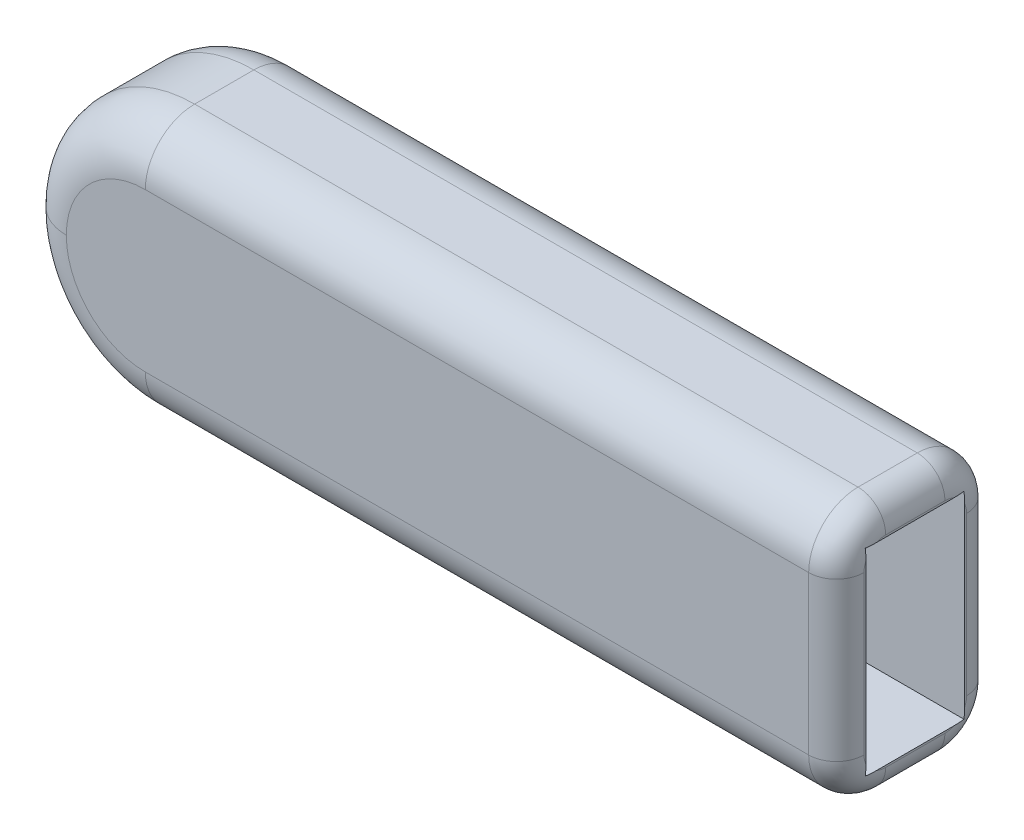
ISO-10303-21;
HEADER;
FILE_DESCRIPTION(('STEP AP214'),'2;1');
FILE_NAME('part.step','',(''),(''),'','','');
FILE_SCHEMA(('AUTOMOTIVE_DESIGN { 1 0 10303 214 1 1 1 1 }'));
ENDSEC;
DATA;
#1=APPLICATION_CONTEXT('core data for automotive mechanical design processes');
#2=APPLICATION_PROTOCOL_DEFINITION('international standard','automotive_design',2000,#1);
#3=PRODUCT_CONTEXT('',#1,'mechanical');
#4=PRODUCT('Part','Part','',(#3));
#5=PRODUCT_RELATED_PRODUCT_CATEGORY('part','',(#4));
#6=PRODUCT_DEFINITION_FORMATION('','',#4);
#7=PRODUCT_DEFINITION_CONTEXT('part definition',#1,'design');
#8=PRODUCT_DEFINITION('design','',#6,#7);
#9=PRODUCT_DEFINITION_SHAPE('','',#8);
#10=(LENGTH_UNIT() NAMED_UNIT(*) SI_UNIT(.MILLI.,.METRE.));
#11=(NAMED_UNIT(*) PLANE_ANGLE_UNIT() SI_UNIT($,.RADIAN.));
#12=(NAMED_UNIT(*) SI_UNIT($,.STERADIAN.) SOLID_ANGLE_UNIT());
#13=UNCERTAINTY_MEASURE_WITH_UNIT(LENGTH_MEASURE(1.E-05),#10,'distance_accuracy_value','');
#14=(GEOMETRIC_REPRESENTATION_CONTEXT(3) GLOBAL_UNCERTAINTY_ASSIGNED_CONTEXT((#13)) GLOBAL_UNIT_ASSIGNED_CONTEXT((#10,
#11,#12)) REPRESENTATION_CONTEXT('',''));
#15=CARTESIAN_POINT('',(0.,0.,0.));
#16=DIRECTION('',(0.,0.,1.));
#17=DIRECTION('',(1.,0.,0.));
#18=AXIS2_PLACEMENT_3D('',#15,#16,#17);
#19=CARTESIAN_POINT('',(50.8,12.7,6.35));
#20=DIRECTION('',(1.,0.,0.));
#21=DIRECTION('',(0.,0.,-1.));
#22=AXIS2_PLACEMENT_3D('',#19,#20,#21);
#23=PLANE('',#22);
#24=DIRECTION('',(0.,-1.,0.));
#25=VECTOR('',#24,1.);
#26=CARTESIAN_POINT('',(50.8,12.7,-0.127));
#27=LINE('',#26,#25);
#28=CARTESIAN_POINT('',(50.8,1.27,-0.126999999999999));
#29=VERTEX_POINT('',#28);
#30=CARTESIAN_POINT('',(50.8,11.43,-0.127));
#31=VERTEX_POINT('',#30);
#32=EDGE_CURVE('E372',#29,#31,#27,.F.);
#33=ORIENTED_EDGE('',*,*,#32,.T.);
#34=CARTESIAN_POINT('',(50.8,11.43,1.27));
#35=DIRECTION('',(1.,0.,0.));
#36=DIRECTION('',(0.,0.,-1.));
#37=AXIS2_PLACEMENT_3D('',#34,#35,#36);
#38=CIRCLE('',#37,1.397);
#39=CARTESIAN_POINT('',(50.8,12.0119871132594,0.));
#40=VERTEX_POINT('',#39);
#41=EDGE_CURVE('E376',#31,#40,#38,.T.);
#42=ORIENTED_EDGE('',*,*,#41,.T.);
#43=DIRECTION('',(0.,-1.,0.));
#44=VECTOR('',#43,1.);
#45=CARTESIAN_POINT('',(50.8,12.7,0.));
#46=LINE('',#45,#44);
#47=CARTESIAN_POINT('',(50.8,0.68801288674061,0.));
#48=VERTEX_POINT('',#47);
#49=EDGE_CURVE('E579',#40,#48,#46,.T.);
#50=ORIENTED_EDGE('',*,*,#49,.T.);
#51=CARTESIAN_POINT('',(50.8,1.27,1.27));
#52=DIRECTION('',(1.,0.,0.));
#53=DIRECTION('',(0.,0.,-1.));
#54=AXIS2_PLACEMENT_3D('',#51,#52,#53);
#55=CIRCLE('',#54,1.397);
#56=EDGE_CURVE('E369',#48,#29,#55,.T.);
#57=ORIENTED_EDGE('',*,*,#56,.T.);
#58=EDGE_LOOP('',(#33,#42,#50,#57));
#59=FACE_BOUND('',#58,.T.);
#60=ADVANCED_FACE('F51',(#59),#23,.T.);
#61=DIRECTION('',(0.,0.,-1.));
#62=VECTOR('',#61,1.);
#63=CARTESIAN_POINT('',(50.8,12.7,6.35));
#64=LINE('',#63,#62);
#65=CARTESIAN_POINT('',(50.8,12.7,5.66198711325939));
#66=VERTEX_POINT('',#65);
#67=CARTESIAN_POINT('',(50.8,12.7,0.68801288674061));
#68=VERTEX_POINT('',#67);
#69=EDGE_CURVE('E585',#66,#68,#64,.T.);
#70=ORIENTED_EDGE('',*,*,#69,.T.);
#71=CARTESIAN_POINT('',(50.8,11.43,1.27));
#72=DIRECTION('',(1.,0.,0.));
#73=DIRECTION('',(0.,0.,-1.));
#74=AXIS2_PLACEMENT_3D('',#71,#72,#73);
#75=CIRCLE('',#74,1.397);
#76=CARTESIAN_POINT('',(50.8,12.827,1.27));
#77=VERTEX_POINT('',#76);
#78=EDGE_CURVE('E366',#68,#77,#75,.T.);
#79=ORIENTED_EDGE('',*,*,#78,.T.);
#80=DIRECTION('',(0.,0.,-1.));
#81=VECTOR('',#80,1.);
#82=CARTESIAN_POINT('',(50.8,12.827,5.08));
#83=LINE('',#82,#81);
#84=CARTESIAN_POINT('',(50.8,12.827,5.08));
#85=VERTEX_POINT('',#84);
#86=EDGE_CURVE('E363',#77,#85,#83,.F.);
#87=ORIENTED_EDGE('',*,*,#86,.T.);
#88=CARTESIAN_POINT('',(50.8,11.43,5.08));
#89=DIRECTION('',(1.,0.,0.));
#90=DIRECTION('',(0.,0.,-1.));
#91=AXIS2_PLACEMENT_3D('',#88,#89,#90);
#92=CIRCLE('',#91,1.397);
#93=EDGE_CURVE('E360',#85,#66,#92,.T.);
#94=ORIENTED_EDGE('',*,*,#93,.T.);
#95=EDGE_LOOP('',(#70,#79,#87,#94));
#96=FACE_BOUND('',#95,.T.);
#97=ADVANCED_FACE('F494',(#96),#23,.T.);
#98=DIRECTION('',(0.,0.,-1.));
#99=VECTOR('',#98,1.);
#100=CARTESIAN_POINT('',(50.8,-0.127,1.27));
#101=LINE('',#100,#99);
#102=CARTESIAN_POINT('',(50.8,-0.127,5.08));
#103=VERTEX_POINT('',#102);
#104=CARTESIAN_POINT('',(50.8,-0.127,1.27));
#105=VERTEX_POINT('',#104);
#106=EDGE_CURVE('E354',#103,#105,#101,.T.);
#107=ORIENTED_EDGE('',*,*,#106,.T.);
#108=CARTESIAN_POINT('',(50.8,1.27,1.27));
#109=DIRECTION('',(1.,0.,0.));
#110=DIRECTION('',(0.,0.,-1.));
#111=AXIS2_PLACEMENT_3D('',#108,#109,#110);
#112=CIRCLE('',#111,1.397);
#113=CARTESIAN_POINT('',(50.8,0.,0.68801288674061));
#114=VERTEX_POINT('',#113);
#115=EDGE_CURVE('E357',#105,#114,#112,.T.);
#116=ORIENTED_EDGE('',*,*,#115,.T.);
#117=DIRECTION('',(0.,0.,-1.));
#118=VECTOR('',#117,1.);
#119=CARTESIAN_POINT('',(50.8,0.,6.35));
#120=LINE('',#119,#118);
#121=CARTESIAN_POINT('',(50.8,0.,5.66198711325939));
#122=VERTEX_POINT('',#121);
#123=EDGE_CURVE('E220',#122,#114,#120,.T.);
#124=ORIENTED_EDGE('',*,*,#123,.F.);
#125=CARTESIAN_POINT('',(50.8,1.27,5.08));
#126=DIRECTION('',(1.,0.,0.));
#127=DIRECTION('',(0.,0.,-1.));
#128=AXIS2_PLACEMENT_3D('',#125,#126,#127);
#129=CIRCLE('',#128,1.397);
#130=EDGE_CURVE('E351',#122,#103,#129,.T.);
#131=ORIENTED_EDGE('',*,*,#130,.T.);
#132=EDGE_LOOP('',(#107,#116,#124,#131));
#133=FACE_BOUND('',#132,.T.);
#134=ADVANCED_FACE('F501',(#133),#23,.T.);
#135=DIRECTION('',(0.,-1.,0.));
#136=VECTOR('',#135,1.);
#137=CARTESIAN_POINT('',(50.8,12.7,6.35));
#138=LINE('',#137,#136);
#139=CARTESIAN_POINT('',(50.8,12.0119871132594,6.35));
#140=VERTEX_POINT('',#139);
#141=CARTESIAN_POINT('',(50.8,0.688012886740608,6.35));
#142=VERTEX_POINT('',#141);
#143=EDGE_CURVE('E517',#140,#142,#138,.T.);
#144=ORIENTED_EDGE('',*,*,#143,.F.);
#145=CARTESIAN_POINT('',(50.8,11.43,5.08));
#146=DIRECTION('',(1.,0.,0.));
#147=DIRECTION('',(0.,0.,-1.));
#148=AXIS2_PLACEMENT_3D('',#145,#146,#147);
#149=CIRCLE('',#148,1.397);
#150=CARTESIAN_POINT('',(50.8,11.43,6.477));
#151=VERTEX_POINT('',#150);
#152=EDGE_CURVE('E348',#140,#151,#149,.T.);
#153=ORIENTED_EDGE('',*,*,#152,.T.);
#154=DIRECTION('',(0.,-1.,0.));
#155=VECTOR('',#154,1.);
#156=CARTESIAN_POINT('',(50.8,1.27,6.477));
#157=LINE('',#156,#155);
#158=CARTESIAN_POINT('',(50.8,1.27,6.477));
#159=VERTEX_POINT('',#158);
#160=EDGE_CURVE('E342',#151,#159,#157,.T.);
#161=ORIENTED_EDGE('',*,*,#160,.T.);
#162=CARTESIAN_POINT('',(50.8,1.27,5.08));
#163=DIRECTION('',(1.,0.,0.));
#164=DIRECTION('',(0.,0.,-1.));
#165=AXIS2_PLACEMENT_3D('',#162,#163,#164);
#166=CIRCLE('',#165,1.397);
#167=EDGE_CURVE('E345',#159,#142,#166,.T.);
#168=ORIENTED_EDGE('',*,*,#167,.T.);
#169=EDGE_LOOP('',(#144,#153,#161,#168));
#170=FACE_BOUND('',#169,.T.);
#171=ADVANCED_FACE('F497',(#170),#23,.T.);
#172=CARTESIAN_POINT('',(0.,-1.905,6.35));
#173=DIRECTION('',(0.,1.,0.));
#174=DIRECTION('',(0.,0.,1.));
#175=AXIS2_PLACEMENT_3D('',#172,#173,#174);
#176=PLANE('',#175);
#177=DIRECTION('',(1.,0.,0.));
#178=VECTOR('',#177,1.);
#179=CARTESIAN_POINT('',(50.8,-1.905,1.27));
#180=LINE('',#179,#178);
#181=CARTESIAN_POINT('',(6.35,-1.905,1.27));
#182=VERTEX_POINT('',#181);
#183=CARTESIAN_POINT('',(49.022,-1.905,1.27));
#184=VERTEX_POINT('',#183);
#185=EDGE_CURVE('E267',#182,#184,#180,.T.);
#186=ORIENTED_EDGE('',*,*,#185,.T.);
#187=DIRECTION('',(0.,0.,-1.));
#188=VECTOR('',#187,1.);
#189=CARTESIAN_POINT('',(49.022,-1.905,5.08));
#190=LINE('',#189,#188);
#191=CARTESIAN_POINT('',(49.022,-1.905,5.08));
#192=VERTEX_POINT('',#191);
#193=EDGE_CURVE('E437',#184,#192,#190,.F.);
#194=ORIENTED_EDGE('',*,*,#193,.T.);
#195=DIRECTION('',(1.,0.,0.));
#196=VECTOR('',#195,1.);
#197=CARTESIAN_POINT('',(0.,-1.905,5.08));
#198=LINE('',#197,#196);
#199=CARTESIAN_POINT('',(6.35,-1.905,5.08));
#200=VERTEX_POINT('',#199);
#201=EDGE_CURVE('E257',#192,#200,#198,.F.);
#202=ORIENTED_EDGE('',*,*,#201,.T.);
#203=DIRECTION('',(0.,0.,1.));
#204=VECTOR('',#203,1.);
#205=CARTESIAN_POINT('',(6.35,-1.905,6.35));
#206=LINE('',#205,#204);
#207=EDGE_CURVE('E253',#200,#182,#206,.F.);
#208=ORIENTED_EDGE('',*,*,#207,.T.);
#209=EDGE_LOOP('',(#186,#194,#202,#208));
#210=FACE_BOUND('',#209,.T.);
#211=ADVANCED_FACE('F506',(#210),#176,.F.);
#212=CARTESIAN_POINT('',(50.8,14.605,6.35));
#213=DIRECTION('',(0.,-1.,0.));
#214=DIRECTION('',(1.,0.,0.));
#215=AXIS2_PLACEMENT_3D('',#212,#213,#214);
#216=PLANE('',#215);
#217=DIRECTION('',(-1.,0.,0.));
#218=VECTOR('',#217,1.);
#219=CARTESIAN_POINT('',(50.8,14.605,5.08));
#220=LINE('',#219,#218);
#221=CARTESIAN_POINT('',(6.35,14.605,5.08));
#222=VERTEX_POINT('',#221);
#223=CARTESIAN_POINT('',(49.022,14.605,5.08));
#224=VERTEX_POINT('',#223);
#225=EDGE_CURVE('E308',#222,#224,#220,.F.);
#226=ORIENTED_EDGE('',*,*,#225,.T.);
#227=DIRECTION('',(0.,0.,-1.));
#228=VECTOR('',#227,1.);
#229=CARTESIAN_POINT('',(49.022,14.605,1.27));
#230=LINE('',#229,#228);
#231=CARTESIAN_POINT('',(49.022,14.605,1.27));
#232=VERTEX_POINT('',#231);
#233=EDGE_CURVE('E434',#224,#232,#230,.T.);
#234=ORIENTED_EDGE('',*,*,#233,.T.);
#235=DIRECTION('',(-1.,0.,0.));
#236=VECTOR('',#235,1.);
#237=CARTESIAN_POINT('',(6.35,14.605,1.27));
#238=LINE('',#237,#236);
#239=CARTESIAN_POINT('',(6.35,14.605,1.27));
#240=VERTEX_POINT('',#239);
#241=EDGE_CURVE('E312',#232,#240,#238,.T.);
#242=ORIENTED_EDGE('',*,*,#241,.T.);
#243=DIRECTION('',(0.,0.,1.));
#244=VECTOR('',#243,1.);
#245=CARTESIAN_POINT('',(6.35,14.605,6.35));
#246=LINE('',#245,#244);
#247=EDGE_CURVE('E258',#240,#222,#246,.T.);
#248=ORIENTED_EDGE('',*,*,#247,.T.);
#249=EDGE_LOOP('',(#226,#234,#242,#248));
#250=FACE_BOUND('',#249,.T.);
#251=ADVANCED_FACE('F512',(#250),#216,.F.);
#252=CARTESIAN_POINT('',(0.,0.,8.255));
#253=DIRECTION('',(0.,0.,-1.));
#254=DIRECTION('',(-1.,0.,0.));
#255=AXIS2_PLACEMENT_3D('',#252,#253,#254);
#256=PLANE('',#255);
#257=DIRECTION('',(1.,0.,0.));
#258=VECTOR('',#257,1.);
#259=CARTESIAN_POINT('',(0.,1.27,8.255));
#260=LINE('',#259,#258);
#261=CARTESIAN_POINT('',(6.35,1.27,8.255));
#262=VERTEX_POINT('',#261);
#263=CARTESIAN_POINT('',(49.022,1.27,8.255));
#264=VERTEX_POINT('',#263);
#265=EDGE_CURVE('E293',#262,#264,#260,.T.);
#266=ORIENTED_EDGE('',*,*,#265,.T.);
#267=DIRECTION('',(0.,-1.,0.));
#268=VECTOR('',#267,1.);
#269=CARTESIAN_POINT('',(49.022,11.43,8.255));
#270=LINE('',#269,#268);
#271=CARTESIAN_POINT('',(49.022,11.43,8.255));
#272=VERTEX_POINT('',#271);
#273=EDGE_CURVE('E11',#264,#272,#270,.F.);
#274=ORIENTED_EDGE('',*,*,#273,.T.);
#275=DIRECTION('',(-1.,0.,0.));
#276=VECTOR('',#275,1.);
#277=CARTESIAN_POINT('',(0.,11.43,8.255));
#278=LINE('',#277,#276);
#279=CARTESIAN_POINT('',(6.35,11.43,8.255));
#280=VERTEX_POINT('',#279);
#281=EDGE_CURVE('E284',#272,#280,#278,.T.);
#282=ORIENTED_EDGE('',*,*,#281,.T.);
#283=CARTESIAN_POINT('',(6.35,6.35000000000001,8.255));
#284=DIRECTION('',(0.,0.,-1.));
#285=DIRECTION('',(-1.,0.,0.));
#286=AXIS2_PLACEMENT_3D('',#283,#284,#285);
#287=CIRCLE('',#286,5.08);
#288=CARTESIAN_POINT('',(1.27,6.35,8.255));
#289=VERTEX_POINT('',#288);
#290=EDGE_CURVE('E287',#280,#289,#287,.F.);
#291=ORIENTED_EDGE('',*,*,#290,.T.);
#292=CARTESIAN_POINT('',(6.35,6.35,8.255));
#293=DIRECTION('',(0.,0.,-1.));
#294=DIRECTION('',(-1.,0.,0.));
#295=AXIS2_PLACEMENT_3D('',#292,#293,#294);
#296=CIRCLE('',#295,5.08);
#297=EDGE_CURVE('E290',#289,#262,#296,.F.);
#298=ORIENTED_EDGE('',*,*,#297,.T.);
#299=EDGE_LOOP('',(#266,#274,#282,#291,#298));
#300=FACE_BOUND('',#299,.T.);
#301=ADVANCED_FACE('F849',(#300),#256,.F.);
#302=CARTESIAN_POINT('',(0.,0.,-1.905));
#303=DIRECTION('',(0.,0.,-1.));
#304=DIRECTION('',(-1.,0.,0.));
#305=AXIS2_PLACEMENT_3D('',#302,#303,#304);
#306=PLANE('',#305);
#307=DIRECTION('',(-1.,0.,0.));
#308=VECTOR('',#307,1.);
#309=CARTESIAN_POINT('',(50.8,11.43,-1.905));
#310=LINE('',#309,#308);
#311=CARTESIAN_POINT('',(6.35,11.43,-1.905));
#312=VERTEX_POINT('',#311);
#313=CARTESIAN_POINT('',(49.022,11.43,-1.905));
#314=VERTEX_POINT('',#313);
#315=EDGE_CURVE('E271',#312,#314,#310,.F.);
#316=ORIENTED_EDGE('',*,*,#315,.T.);
#317=DIRECTION('',(0.,-1.,0.));
#318=VECTOR('',#317,1.);
#319=CARTESIAN_POINT('',(49.022,0.,-1.905));
#320=LINE('',#319,#318);
#321=CARTESIAN_POINT('',(49.022,1.27,-1.905));
#322=VERTEX_POINT('',#321);
#323=EDGE_CURVE('E315',#314,#322,#320,.T.);
#324=ORIENTED_EDGE('',*,*,#323,.T.);
#325=DIRECTION('',(1.,0.,0.));
#326=VECTOR('',#325,1.);
#327=CARTESIAN_POINT('',(6.35,1.27,-1.905));
#328=LINE('',#327,#326);
#329=CARTESIAN_POINT('',(6.35,1.27,-1.905));
#330=VERTEX_POINT('',#329);
#331=EDGE_CURVE('E281',#322,#330,#328,.F.);
#332=ORIENTED_EDGE('',*,*,#331,.T.);
#333=CARTESIAN_POINT('',(6.35,6.35,-1.905));
#334=DIRECTION('',(0.,0.,-1.));
#335=DIRECTION('',(-1.,0.,0.));
#336=AXIS2_PLACEMENT_3D('',#333,#334,#335);
#337=CIRCLE('',#336,5.08);
#338=CARTESIAN_POINT('',(1.27,6.35,-1.905));
#339=VERTEX_POINT('',#338);
#340=EDGE_CURVE('E278',#330,#339,#337,.T.);
#341=ORIENTED_EDGE('',*,*,#340,.T.);
#342=CARTESIAN_POINT('',(6.35,6.35000000000001,-1.905));
#343=DIRECTION('',(0.,0.,-1.));
#344=DIRECTION('',(-1.,0.,0.));
#345=AXIS2_PLACEMENT_3D('',#342,#343,#344);
#346=CIRCLE('',#345,5.08);
#347=EDGE_CURVE('E275',#339,#312,#346,.T.);
#348=ORIENTED_EDGE('',*,*,#347,.T.);
#349=EDGE_LOOP('',(#316,#324,#332,#341,#348));
#350=FACE_BOUND('',#349,.T.);
#351=ADVANCED_FACE('F842',(#350),#306,.T.);
#352=CARTESIAN_POINT('',(6.35,6.35,6.35));
#353=DIRECTION('',(0.,0.,1.));
#354=DIRECTION('',(1.,0.,0.));
#355=AXIS2_PLACEMENT_3D('',#352,#353,#354);
#356=CYLINDRICAL_SURFACE('',#355,8.255);
#357=DIRECTION('',(0.,0.,1.));
#358=VECTOR('',#357,1.);
#359=CARTESIAN_POINT('',(-1.905,6.35,6.35));
#360=LINE('',#359,#358);
#361=CARTESIAN_POINT('',(-1.905,6.35,1.27));
#362=VERTEX_POINT('',#361);
#363=CARTESIAN_POINT('',(-1.905,6.35,5.08));
#364=VERTEX_POINT('',#363);
#365=EDGE_CURVE('E251',#362,#364,#360,.T.);
#366=ORIENTED_EDGE('',*,*,#365,.F.);
#367=CARTESIAN_POINT('',(6.35,6.35,1.27));
#368=DIRECTION('',(0.,0.,-1.));
#369=DIRECTION('',(-1.,0.,0.));
#370=AXIS2_PLACEMENT_3D('',#367,#368,#369);
#371=CIRCLE('',#370,8.255);
#372=EDGE_CURVE('E299',#362,#182,#371,.F.);
#373=ORIENTED_EDGE('',*,*,#372,.T.);
#374=ORIENTED_EDGE('',*,*,#207,.F.);
#375=CARTESIAN_POINT('',(6.35,6.35,5.08));
#376=DIRECTION('',(0.,0.,-1.));
#377=DIRECTION('',(-1.,0.,0.));
#378=AXIS2_PLACEMENT_3D('',#375,#376,#377);
#379=CIRCLE('',#378,8.255);
#380=EDGE_CURVE('E296',#200,#364,#379,.T.);
#381=ORIENTED_EDGE('',*,*,#380,.T.);
#382=EDGE_LOOP('',(#366,#373,#374,#381));
#383=FACE_BOUND('',#382,.T.);
#384=ADVANCED_FACE('F848',(#383),#356,.T.);
#385=CARTESIAN_POINT('',(6.35,6.35000000000001,6.35));
#386=DIRECTION('',(0.,0.,1.));
#387=DIRECTION('',(1.,0.,0.));
#388=AXIS2_PLACEMENT_3D('',#385,#386,#387);
#389=CYLINDRICAL_SURFACE('',#388,8.255);
#390=ORIENTED_EDGE('',*,*,#247,.F.);
#391=CARTESIAN_POINT('',(6.35,6.35000000000001,1.27));
#392=DIRECTION('',(0.,0.,-1.));
#393=DIRECTION('',(-1.,0.,0.));
#394=AXIS2_PLACEMENT_3D('',#391,#392,#393);
#395=CIRCLE('',#394,8.255);
#396=EDGE_CURVE('E305',#240,#362,#395,.F.);
#397=ORIENTED_EDGE('',*,*,#396,.T.);
#398=ORIENTED_EDGE('',*,*,#365,.T.);
#399=CARTESIAN_POINT('',(6.35,6.35000000000001,5.08));
#400=DIRECTION('',(0.,0.,-1.));
#401=DIRECTION('',(-1.,0.,0.));
#402=AXIS2_PLACEMENT_3D('',#399,#400,#401);
#403=CIRCLE('',#402,8.255);
#404=EDGE_CURVE('E302',#364,#222,#403,.T.);
#405=ORIENTED_EDGE('',*,*,#404,.T.);
#406=EDGE_LOOP('',(#390,#397,#398,#405));
#407=FACE_BOUND('',#406,.T.);
#408=ADVANCED_FACE('F410',(#407),#389,.T.);
#409=CARTESIAN_POINT('',(0.,0.,6.35));
#410=DIRECTION('',(0.,1.,0.));
#411=DIRECTION('',(0.,0.,1.));
#412=AXIS2_PLACEMENT_3D('',#409,#410,#411);
#413=PLANE('',#412);
#414=ORIENTED_EDGE('',*,*,#123,.T.);
#415=CARTESIAN_POINT('',(50.8,0.,0.688012886740609));
#416=CARTESIAN_POINT('',(50.8000053117979,0.,0.630477997647595));
#417=CARTESIAN_POINT('',(50.7995166702924,0.,0.572923593735409));
#418=CARTESIAN_POINT('',(50.7968595474228,0.,0.457953639954135));
#419=CARTESIAN_POINT('',(50.7946938872655,0.,0.400538019177213));
#420=CARTESIAN_POINT('',(50.7879927165779,0.,0.285782795260271));
#421=CARTESIAN_POINT('',(50.7834552648454,0.,0.228443293016474));
#422=CARTESIAN_POINT('',(50.7714192368759,0.,0.11398388051647));
#423=CARTESIAN_POINT('',(50.7639157076623,0.,0.0568644997640226));
#424=CARTESIAN_POINT('',(50.754640216679,0.,0.));
#425=B_SPLINE_CURVE_WITH_KNOTS('',3,(#415,#416,#417,#418,#419,#420,#421,#422,#423,#424),
.UNSPECIFIED.,.F.,.F.,(4,2,2,2,4),(0.,0.172632078925998,0.34497437244895,0.517457941581219,
0.690230761660564),.UNSPECIFIED.);
#426=CARTESIAN_POINT('',(50.754640216679,0.,0.));
#427=VERTEX_POINT('',#426);
#428=EDGE_CURVE('E424',#114,#427,#425,.T.);
#429=ORIENTED_EDGE('',*,*,#428,.T.);
#430=DIRECTION('',(1.,0.,0.));
#431=VECTOR('',#430,1.);
#432=CARTESIAN_POINT('',(0.,0.,0.));
#433=LINE('',#432,#431);
#434=CARTESIAN_POINT('',(6.35,0.,0.));
#435=VERTEX_POINT('',#434);
#436=EDGE_CURVE('E574',#435,#427,#433,.T.);
#437=ORIENTED_EDGE('',*,*,#436,.F.);
#438=DIRECTION('',(0.,0.,-1.));
#439=VECTOR('',#438,1.);
#440=CARTESIAN_POINT('',(6.35,0.,0.));
#441=LINE('',#440,#439);
#442=CARTESIAN_POINT('',(6.35,0.,6.35));
#443=VERTEX_POINT('',#442);
#444=EDGE_CURVE('E213',#443,#435,#441,.T.);
#445=ORIENTED_EDGE('',*,*,#444,.F.);
#446=DIRECTION('',(1.,0.,0.));
#447=VECTOR('',#446,1.);
#448=CARTESIAN_POINT('',(0.,0.,6.35));
#449=LINE('',#448,#447);
#450=CARTESIAN_POINT('',(50.754640216679,0.,6.35));
#451=VERTEX_POINT('',#450);
#452=EDGE_CURVE('E524',#443,#451,#449,.T.);
#453=ORIENTED_EDGE('',*,*,#452,.T.);
#454=CARTESIAN_POINT('',(50.754640216679,0.,6.35));
#455=CARTESIAN_POINT('',(50.7639157076623,0.,6.29313550023598));
#456=CARTESIAN_POINT('',(50.7714192368759,0.,6.23601611948353));
#457=CARTESIAN_POINT('',(50.7834552648454,0.,6.12155670698353));
#458=CARTESIAN_POINT('',(50.7879927165779,0.,6.06421720473973));
#459=CARTESIAN_POINT('',(50.7946938872655,0.,5.94946198082279));
#460=CARTESIAN_POINT('',(50.7968595474228,0.,5.89204636004586));
#461=CARTESIAN_POINT('',(50.7995166702924,0.,5.77707640626459));
#462=CARTESIAN_POINT('',(50.8000053117979,0.,5.7195220023524));
#463=CARTESIAN_POINT('',(50.8,0.,5.66198711325939));
#464=B_SPLINE_CURVE_WITH_KNOTS('',3,(#454,#455,#456,#457,#458,#459,#460,#461,#462,#463),
.UNSPECIFIED.,.F.,.F.,(4,2,2,2,4),(0.,0.172772820079345,0.345256389211614,0.517598682734566,
0.690230761660564),.UNSPECIFIED.);
#465=EDGE_CURVE('E416',#451,#122,#464,.T.);
#466=ORIENTED_EDGE('',*,*,#465,.T.);
#467=EDGE_LOOP('',(#414,#429,#437,#445,#453,#466));
#468=FACE_BOUND('',#467,.T.);
#469=ADVANCED_FACE('F404',(#468),#413,.T.);
#470=CARTESIAN_POINT('',(50.8,12.7,6.35));
#471=DIRECTION('',(0.,-1.,0.));
#472=DIRECTION('',(1.,0.,0.));
#473=AXIS2_PLACEMENT_3D('',#470,#471,#472);
#474=PLANE('',#473);
#475=DIRECTION('',(-1.,0.,0.));
#476=VECTOR('',#475,1.);
#477=CARTESIAN_POINT('',(50.8,12.7,0.));
#478=LINE('',#477,#476);
#479=CARTESIAN_POINT('',(50.754640216679,12.7,0.));
#480=VERTEX_POINT('',#479);
#481=CARTESIAN_POINT('',(6.35,12.7,0.));
#482=VERTEX_POINT('',#481);
#483=EDGE_CURVE('E231',#480,#482,#478,.T.);
#484=ORIENTED_EDGE('',*,*,#483,.F.);
#485=CARTESIAN_POINT('',(50.754640216679,12.7,0.));
#486=CARTESIAN_POINT('',(50.7639157076623,12.7,0.0568644997640226));
#487=CARTESIAN_POINT('',(50.7714192368759,12.7,0.11398388051647));
#488=CARTESIAN_POINT('',(50.7834552648454,12.7,0.228443293016474));
#489=CARTESIAN_POINT('',(50.7879927165779,12.7,0.285782795260271));
#490=CARTESIAN_POINT('',(50.7946938872655,12.7,0.400538019177214));
#491=CARTESIAN_POINT('',(50.7968595474228,12.7,0.457953639954135));
#492=CARTESIAN_POINT('',(50.7995166702924,12.7,0.572923593735409));
#493=CARTESIAN_POINT('',(50.8000053117979,12.7,0.630477997647596));
#494=CARTESIAN_POINT('',(50.8,12.7,0.68801288674061));
#495=B_SPLINE_CURVE_WITH_KNOTS('',3,(#485,#486,#487,#488,#489,#490,#491,#492,#493,#494),
.UNSPECIFIED.,.F.,.F.,(4,2,2,2,4),(0.,0.172772820079345,0.345256389211614,0.517598682734566,
0.690230761660565),.UNSPECIFIED.);
#496=EDGE_CURVE('E473',#480,#68,#495,.T.);
#497=ORIENTED_EDGE('',*,*,#496,.T.);
#498=ORIENTED_EDGE('',*,*,#69,.F.);
#499=CARTESIAN_POINT('',(50.8,12.7,5.66198711325939));
#500=CARTESIAN_POINT('',(50.8000053117979,12.7,5.7195220023524));
#501=CARTESIAN_POINT('',(50.7995166702924,12.7,5.77707640626459));
#502=CARTESIAN_POINT('',(50.7968595474228,12.7,5.89204636004587));
#503=CARTESIAN_POINT('',(50.7946938872655,12.7,5.94946198082279));
#504=CARTESIAN_POINT('',(50.7879927165779,12.7,6.06421720473973));
#505=CARTESIAN_POINT('',(50.7834552648454,12.7,6.12155670698353));
#506=CARTESIAN_POINT('',(50.7714192368759,12.7,6.23601611948353));
#507=CARTESIAN_POINT('',(50.7639157076623,12.7,6.29313550023598));
#508=CARTESIAN_POINT('',(50.754640216679,12.7,6.35));
#509=B_SPLINE_CURVE_WITH_KNOTS('',3,(#499,#500,#501,#502,#503,#504,#505,#506,#507,#508),
.UNSPECIFIED.,.F.,.F.,(4,2,2,2,4),(0.,0.172632078925998,0.344974372448949,0.517457941581218,
0.690230761660563),.UNSPECIFIED.);
#510=CARTESIAN_POINT('',(50.754640216679,12.7,6.35));
#511=VERTEX_POINT('',#510);
#512=EDGE_CURVE('E466',#66,#511,#509,.T.);
#513=ORIENTED_EDGE('',*,*,#512,.T.);
#514=DIRECTION('',(-1.,0.,0.));
#515=VECTOR('',#514,1.);
#516=CARTESIAN_POINT('',(50.8,12.7,6.35));
#517=LINE('',#516,#515);
#518=CARTESIAN_POINT('',(6.35,12.7,6.35));
#519=VERTEX_POINT('',#518);
#520=EDGE_CURVE('E525',#511,#519,#517,.T.);
#521=ORIENTED_EDGE('',*,*,#520,.T.);
#522=DIRECTION('',(0.,0.,-1.));
#523=VECTOR('',#522,1.);
#524=CARTESIAN_POINT('',(6.35,12.7,6.35));
#525=LINE('',#524,#523);
#526=EDGE_CURVE('E238',#482,#519,#525,.F.);
#527=ORIENTED_EDGE('',*,*,#526,.F.);
#528=EDGE_LOOP('',(#484,#497,#498,#513,#521,#527));
#529=FACE_BOUND('',#528,.T.);
#530=ADVANCED_FACE('F409',(#529),#474,.T.);
#531=CARTESIAN_POINT('',(0.,0.,6.35));
#532=DIRECTION('',(0.,0.,-1.));
#533=DIRECTION('',(-1.,0.,0.));
#534=AXIS2_PLACEMENT_3D('',#531,#532,#533);
#535=PLANE('',#534);
#536=ORIENTED_EDGE('',*,*,#520,.F.);
#537=CARTESIAN_POINT('',(50.754640216679,12.7,6.35));
#538=CARTESIAN_POINT('',(50.7639157076623,12.643135500236,6.35));
#539=CARTESIAN_POINT('',(50.7714192368759,12.5860161194835,6.35));
#540=CARTESIAN_POINT('',(50.7834552648454,12.4715567069835,6.35));
#541=CARTESIAN_POINT('',(50.7879927165779,12.4142172047397,6.35));
#542=CARTESIAN_POINT('',(50.7946938872655,12.2994619808228,6.35));
#543=CARTESIAN_POINT('',(50.7968595474228,12.2420463600459,6.35));
#544=CARTESIAN_POINT('',(50.7995166702924,12.1270764062646,6.35));
#545=CARTESIAN_POINT('',(50.8000053117979,12.0695220023524,6.35));
#546=CARTESIAN_POINT('',(50.8,12.0119871132594,6.35));
#547=B_SPLINE_CURVE_WITH_KNOTS('',3,(#537,#538,#539,#540,#541,#542,#543,#544,#545,#546),
.UNSPECIFIED.,.F.,.F.,(4,2,2,2,4),(0.,0.172772820079345,0.345256389211612,0.517598682734562,
0.69023076166056),.UNSPECIFIED.);
#548=EDGE_CURVE('E447',#511,#140,#547,.T.);
#549=ORIENTED_EDGE('',*,*,#548,.T.);
#550=ORIENTED_EDGE('',*,*,#143,.T.);
#551=CARTESIAN_POINT('',(50.8,0.688012886740608,6.35));
#552=CARTESIAN_POINT('',(50.8000053117979,0.630477997647594,6.35));
#553=CARTESIAN_POINT('',(50.7995166702924,0.572923593735407,6.35));
#554=CARTESIAN_POINT('',(50.7968595474228,0.457953639954134,6.35));
#555=CARTESIAN_POINT('',(50.7946938872655,0.400538019177212,6.35));
#556=CARTESIAN_POINT('',(50.7879927165779,0.28578279526027,6.35));
#557=CARTESIAN_POINT('',(50.7834552648454,0.228443293016473,6.35));
#558=CARTESIAN_POINT('',(50.7714192368759,0.113983880516469,6.35));
#559=CARTESIAN_POINT('',(50.7639157076623,0.0568644997640221,6.35));
#560=CARTESIAN_POINT('',(50.754640216679,0.,6.35));
#561=B_SPLINE_CURVE_WITH_KNOTS('',3,(#551,#552,#553,#554,#555,#556,#557,#558,#559,#560),
.UNSPECIFIED.,.F.,.F.,(4,2,2,2,4),(0.,0.172632078925998,0.34497437244895,0.517457941581218,
0.690230761660562),.UNSPECIFIED.);
#562=EDGE_CURVE('E440',#142,#451,#561,.T.);
#563=ORIENTED_EDGE('',*,*,#562,.T.);
#564=ORIENTED_EDGE('',*,*,#452,.F.);
#565=CARTESIAN_POINT('',(6.35,6.35,6.35));
#566=DIRECTION('',(0.,0.,-1.));
#567=DIRECTION('',(-1.,0.,0.));
#568=AXIS2_PLACEMENT_3D('',#565,#566,#567);
#569=CIRCLE('',#568,6.35);
#570=CARTESIAN_POINT('',(0.,6.35,6.35));
#571=VERTEX_POINT('',#570);
#572=EDGE_CURVE('E242',#571,#443,#569,.F.);
#573=ORIENTED_EDGE('',*,*,#572,.F.);
#574=CARTESIAN_POINT('',(6.35,6.35000000000001,6.35));
#575=DIRECTION('',(0.,0.,-1.));
#576=DIRECTION('',(-1.,0.,0.));
#577=AXIS2_PLACEMENT_3D('',#574,#575,#576);
#578=CIRCLE('',#577,6.35);
#579=EDGE_CURVE('E228',#519,#571,#578,.F.);
#580=ORIENTED_EDGE('',*,*,#579,.F.);
#581=EDGE_LOOP('',(#536,#549,#550,#563,#564,#573,#580));
#582=FACE_BOUND('',#581,.T.);
#583=ADVANCED_FACE('F402',(#582),#535,.T.);
#584=CARTESIAN_POINT('',(0.,0.,0.));
#585=DIRECTION('',(0.,0.,-1.));
#586=DIRECTION('',(-1.,0.,0.));
#587=AXIS2_PLACEMENT_3D('',#584,#585,#586);
#588=PLANE('',#587);
#589=ORIENTED_EDGE('',*,*,#49,.F.);
#590=CARTESIAN_POINT('',(50.8,12.0119871132594,0.));
#591=CARTESIAN_POINT('',(50.8000053117979,12.0695220023524,0.));
#592=CARTESIAN_POINT('',(50.7995166702924,12.1270764062646,0.));
#593=CARTESIAN_POINT('',(50.7968595474228,12.2420463600459,0.));
#594=CARTESIAN_POINT('',(50.7946938872655,12.2994619808228,0.));
#595=CARTESIAN_POINT('',(50.7879927165779,12.4142172047397,0.));
#596=CARTESIAN_POINT('',(50.7834552648454,12.4715567069835,0.));
#597=CARTESIAN_POINT('',(50.7714192368759,12.5860161194835,0.));
#598=CARTESIAN_POINT('',(50.7639157076623,12.643135500236,0.));
#599=CARTESIAN_POINT('',(50.754640216679,12.7,0.));
#600=B_SPLINE_CURVE_WITH_KNOTS('',3,(#590,#591,#592,#593,#594,#595,#596,#597,#598,#599),
.UNSPECIFIED.,.F.,.F.,(4,2,2,2,4),(0.,0.172632078925998,0.34497437244895,0.517457941581217,
0.690230761660564),.UNSPECIFIED.);
#601=EDGE_CURVE('E388',#40,#480,#600,.T.);
#602=ORIENTED_EDGE('',*,*,#601,.T.);
#603=ORIENTED_EDGE('',*,*,#483,.T.);
#604=CARTESIAN_POINT('',(6.35,6.35000000000001,0.));
#605=DIRECTION('',(0.,0.,-1.));
#606=DIRECTION('',(-1.,0.,0.));
#607=AXIS2_PLACEMENT_3D('',#604,#605,#606);
#608=CIRCLE('',#607,6.35);
#609=CARTESIAN_POINT('',(0.,6.35,0.));
#610=VERTEX_POINT('',#609);
#611=EDGE_CURVE('E219',#610,#482,#608,.T.);
#612=ORIENTED_EDGE('',*,*,#611,.F.);
#613=CARTESIAN_POINT('',(6.35,6.35,0.));
#614=DIRECTION('',(0.,0.,-1.));
#615=DIRECTION('',(-1.,0.,0.));
#616=AXIS2_PLACEMENT_3D('',#613,#614,#615);
#617=CIRCLE('',#616,6.35);
#618=EDGE_CURVE('E208',#435,#610,#617,.T.);
#619=ORIENTED_EDGE('',*,*,#618,.F.);
#620=ORIENTED_EDGE('',*,*,#436,.T.);
#621=CARTESIAN_POINT('',(50.754640216679,0.,0.));
#622=CARTESIAN_POINT('',(50.7639157076623,0.0568644997640225,0.));
#623=CARTESIAN_POINT('',(50.7714192368759,0.11398388051647,0.));
#624=CARTESIAN_POINT('',(50.7834552648454,0.228443293016474,0.));
#625=CARTESIAN_POINT('',(50.7879927165779,0.285782795260271,0.));
#626=CARTESIAN_POINT('',(50.7946938872655,0.400538019177214,0.));
#627=CARTESIAN_POINT('',(50.7968595474228,0.457953639954135,0.));
#628=CARTESIAN_POINT('',(50.7995166702924,0.572923593735409,0.));
#629=CARTESIAN_POINT('',(50.8000053117979,0.630477997647596,0.));
#630=CARTESIAN_POINT('',(50.8,0.68801288674061,0.));
#631=B_SPLINE_CURVE_WITH_KNOTS('',3,(#621,#622,#623,#624,#625,#626,#627,#628,#629,#630),
.UNSPECIFIED.,.F.,.F.,(4,2,2,2,4),(0.,0.172772820079345,0.345256389211614,0.517598682734566,
0.690230761660564),.UNSPECIFIED.);
#632=EDGE_CURVE('E379',#427,#48,#631,.T.);
#633=ORIENTED_EDGE('',*,*,#632,.T.);
#634=EDGE_LOOP('',(#589,#602,#603,#612,#619,#620,#633));
#635=FACE_BOUND('',#634,.T.);
#636=ADVANCED_FACE('F235',(#635),#588,.F.);
#637=CARTESIAN_POINT('',(6.35,6.35,6.35));
#638=DIRECTION('',(0.,0.,1.));
#639=DIRECTION('',(1.,0.,0.));
#640=AXIS2_PLACEMENT_3D('',#637,#638,#639);
#641=CYLINDRICAL_SURFACE('',#640,6.35);
#642=ORIENTED_EDGE('',*,*,#444,.T.);
#643=ORIENTED_EDGE('',*,*,#618,.T.);
#644=DIRECTION('',(0.,0.,-1.));
#645=VECTOR('',#644,1.);
#646=CARTESIAN_POINT('',(0.,6.35,6.35));
#647=LINE('',#646,#645);
#648=EDGE_CURVE('E211',#610,#571,#647,.F.);
#649=ORIENTED_EDGE('',*,*,#648,.T.);
#650=ORIENTED_EDGE('',*,*,#572,.T.);
#651=EDGE_LOOP('',(#642,#643,#649,#650));
#652=FACE_BOUND('',#651,.T.);
#653=ADVANCED_FACE('F210',(#652),#641,.F.);
#654=CARTESIAN_POINT('',(6.35,6.35000000000001,6.35));
#655=DIRECTION('',(0.,0.,1.));
#656=DIRECTION('',(1.,0.,0.));
#657=AXIS2_PLACEMENT_3D('',#654,#655,#656);
#658=CYLINDRICAL_SURFACE('',#657,6.35);
#659=ORIENTED_EDGE('',*,*,#579,.T.);
#660=ORIENTED_EDGE('',*,*,#648,.F.);
#661=ORIENTED_EDGE('',*,*,#611,.T.);
#662=ORIENTED_EDGE('',*,*,#526,.T.);
#663=EDGE_LOOP('',(#659,#660,#661,#662));
#664=FACE_BOUND('',#663,.T.);
#665=ADVANCED_FACE('F224',(#664),#658,.F.);
#666=CARTESIAN_POINT('',(50.8,11.43,1.27));
#667=DIRECTION('',(1.,0.,0.));
#668=DIRECTION('',(0.,1.,0.));
#669=AXIS2_PLACEMENT_3D('',#666,#667,#668);
#670=CYLINDRICAL_SURFACE('',#669,3.175);
#671=ORIENTED_EDGE('',*,*,#241,.F.);
#672=CARTESIAN_POINT('',(49.022,11.43,1.27));
#673=DIRECTION('',(1.,0.,0.));
#674=DIRECTION('',(0.,0.,-1.));
#675=AXIS2_PLACEMENT_3D('',#672,#673,#674);
#676=CIRCLE('',#675,3.175);
#677=EDGE_CURVE('E479',#232,#314,#676,.F.);
#678=ORIENTED_EDGE('',*,*,#677,.T.);
#679=ORIENTED_EDGE('',*,*,#315,.F.);
#680=CARTESIAN_POINT('',(6.35,11.43,1.27));
#681=DIRECTION('',(-1.,0.,0.));
#682=DIRECTION('',(0.,0.,1.));
#683=AXIS2_PLACEMENT_3D('',#680,#681,#682);
#684=CIRCLE('',#683,3.175);
#685=EDGE_CURVE('E232',#240,#312,#684,.T.);
#686=ORIENTED_EDGE('',*,*,#685,.F.);
#687=EDGE_LOOP('',(#671,#678,#679,#686));
#688=FACE_BOUND('',#687,.T.);
#689=ADVANCED_FACE('F627',(#688),#670,.T.);
#690=CARTESIAN_POINT('',(6.35,6.35000000000001,1.27));
#691=DIRECTION('',(0.,0.,-1.));
#692=DIRECTION('',(-1.,0.,0.));
#693=AXIS2_PLACEMENT_3D('',#690,#691,#692);
#694=TOROIDAL_SURFACE('',#693,5.08,3.175);
#695=ORIENTED_EDGE('',*,*,#685,.T.);
#696=ORIENTED_EDGE('',*,*,#347,.F.);
#697=CARTESIAN_POINT('',(1.27,6.35,1.27));
#698=DIRECTION('',(0.,-1.,0.));
#699=DIRECTION('',(0.,0.,-1.));
#700=AXIS2_PLACEMENT_3D('',#697,#698,#699);
#701=CIRCLE('',#700,3.175);
#702=EDGE_CURVE('E320',#362,#339,#701,.T.);
#703=ORIENTED_EDGE('',*,*,#702,.F.);
#704=ORIENTED_EDGE('',*,*,#396,.F.);
#705=EDGE_LOOP('',(#695,#696,#703,#704));
#706=FACE_BOUND('',#705,.T.);
#707=ADVANCED_FACE('F633',(#706),#694,.T.);
#708=CARTESIAN_POINT('',(6.35,6.35,1.27));
#709=DIRECTION('',(0.,0.,-1.));
#710=DIRECTION('',(-1.,0.,0.));
#711=AXIS2_PLACEMENT_3D('',#708,#709,#710);
#712=TOROIDAL_SURFACE('',#711,5.08,3.175);
#713=ORIENTED_EDGE('',*,*,#702,.T.);
#714=ORIENTED_EDGE('',*,*,#340,.F.);
#715=CARTESIAN_POINT('',(6.35,1.27,1.27));
#716=DIRECTION('',(1.,0.,0.));
#717=DIRECTION('',(0.,0.,-1.));
#718=AXIS2_PLACEMENT_3D('',#715,#716,#717);
#719=CIRCLE('',#718,3.175);
#720=EDGE_CURVE('E316',#182,#330,#719,.T.);
#721=ORIENTED_EDGE('',*,*,#720,.F.);
#722=ORIENTED_EDGE('',*,*,#372,.F.);
#723=EDGE_LOOP('',(#713,#714,#721,#722));
#724=FACE_BOUND('',#723,.T.);
#725=ADVANCED_FACE('F641',(#724),#712,.T.);
#726=CARTESIAN_POINT('',(0.,1.27,1.27));
#727=DIRECTION('',(-1.,0.,0.));
#728=DIRECTION('',(0.,0.,1.));
#729=AXIS2_PLACEMENT_3D('',#726,#727,#728);
#730=CYLINDRICAL_SURFACE('',#729,3.175);
#731=ORIENTED_EDGE('',*,*,#331,.F.);
#732=CARTESIAN_POINT('',(49.022,1.27,1.27));
#733=DIRECTION('',(1.,0.,0.));
#734=DIRECTION('',(0.,0.,-1.));
#735=AXIS2_PLACEMENT_3D('',#732,#733,#734);
#736=CIRCLE('',#735,3.175);
#737=EDGE_CURVE('E431',#322,#184,#736,.F.);
#738=ORIENTED_EDGE('',*,*,#737,.T.);
#739=ORIENTED_EDGE('',*,*,#185,.F.);
#740=ORIENTED_EDGE('',*,*,#720,.T.);
#741=EDGE_LOOP('',(#731,#738,#739,#740));
#742=FACE_BOUND('',#741,.T.);
#743=ADVANCED_FACE('F649',(#742),#730,.T.);
#744=CARTESIAN_POINT('',(0.,11.43,5.08));
#745=DIRECTION('',(-1.,0.,0.));
#746=DIRECTION('',(0.,-1.,0.));
#747=AXIS2_PLACEMENT_3D('',#744,#745,#746);
#748=CYLINDRICAL_SURFACE('',#747,3.175);
#749=ORIENTED_EDGE('',*,*,#281,.F.);
#750=CARTESIAN_POINT('',(49.022,11.43,5.08));
#751=DIRECTION('',(1.,0.,0.));
#752=DIRECTION('',(0.,0.,-1.));
#753=AXIS2_PLACEMENT_3D('',#750,#751,#752);
#754=CIRCLE('',#753,3.175);
#755=EDGE_CURVE('E533',#272,#224,#754,.F.);
#756=ORIENTED_EDGE('',*,*,#755,.T.);
#757=ORIENTED_EDGE('',*,*,#225,.F.);
#758=CARTESIAN_POINT('',(6.35,11.43,5.08));
#759=DIRECTION('',(-1.,0.,0.));
#760=DIRECTION('',(0.,-1.,0.));
#761=AXIS2_PLACEMENT_3D('',#758,#759,#760);
#762=CIRCLE('',#761,3.175);
#763=EDGE_CURVE('E321',#280,#222,#762,.T.);
#764=ORIENTED_EDGE('',*,*,#763,.F.);
#765=EDGE_LOOP('',(#749,#756,#757,#764));
#766=FACE_BOUND('',#765,.T.);
#767=ADVANCED_FACE('F657',(#766),#748,.T.);
#768=CARTESIAN_POINT('',(6.35,6.35000000000001,5.08));
#769=DIRECTION('',(0.,0.,-1.));
#770=DIRECTION('',(-1.,0.,0.));
#771=AXIS2_PLACEMENT_3D('',#768,#769,#770);
#772=TOROIDAL_SURFACE('',#771,5.08,3.175);
#773=ORIENTED_EDGE('',*,*,#763,.T.);
#774=ORIENTED_EDGE('',*,*,#404,.F.);
#775=CARTESIAN_POINT('',(1.27,6.35,5.08));
#776=DIRECTION('',(0.,-1.,0.));
#777=DIRECTION('',(0.,0.,-1.));
#778=AXIS2_PLACEMENT_3D('',#775,#776,#777);
#779=CIRCLE('',#778,3.175);
#780=EDGE_CURVE('E332',#289,#364,#779,.T.);
#781=ORIENTED_EDGE('',*,*,#780,.F.);
#782=ORIENTED_EDGE('',*,*,#290,.F.);
#783=EDGE_LOOP('',(#773,#774,#781,#782));
#784=FACE_BOUND('',#783,.T.);
#785=ADVANCED_FACE('F665',(#784),#772,.T.);
#786=CARTESIAN_POINT('',(6.35,6.35,5.08));
#787=DIRECTION('',(0.,0.,-1.));
#788=DIRECTION('',(-1.,0.,0.));
#789=AXIS2_PLACEMENT_3D('',#786,#787,#788);
#790=TOROIDAL_SURFACE('',#789,5.08,3.175);
#791=ORIENTED_EDGE('',*,*,#780,.T.);
#792=ORIENTED_EDGE('',*,*,#380,.F.);
#793=CARTESIAN_POINT('',(6.35,1.27,5.08));
#794=DIRECTION('',(1.,0.,0.));
#795=DIRECTION('',(0.,0.,-1.));
#796=AXIS2_PLACEMENT_3D('',#793,#794,#795);
#797=CIRCLE('',#796,3.175);
#798=EDGE_CURVE('E328',#262,#200,#797,.T.);
#799=ORIENTED_EDGE('',*,*,#798,.F.);
#800=ORIENTED_EDGE('',*,*,#297,.F.);
#801=EDGE_LOOP('',(#791,#792,#799,#800));
#802=FACE_BOUND('',#801,.T.);
#803=ADVANCED_FACE('F672',(#802),#790,.T.);
#804=CARTESIAN_POINT('',(0.,1.27,5.08));
#805=DIRECTION('',(1.,0.,0.));
#806=DIRECTION('',(0.,0.,-1.));
#807=AXIS2_PLACEMENT_3D('',#804,#805,#806);
#808=CYLINDRICAL_SURFACE('',#807,3.175);
#809=ORIENTED_EDGE('',*,*,#201,.F.);
#810=CARTESIAN_POINT('',(49.022,1.27,5.08));
#811=DIRECTION('',(1.,0.,0.));
#812=DIRECTION('',(0.,0.,-1.));
#813=AXIS2_PLACEMENT_3D('',#810,#811,#812);
#814=CIRCLE('',#813,3.175);
#815=EDGE_CURVE('E61',#192,#264,#814,.F.);
#816=ORIENTED_EDGE('',*,*,#815,.T.);
#817=ORIENTED_EDGE('',*,*,#265,.F.);
#818=ORIENTED_EDGE('',*,*,#798,.T.);
#819=EDGE_LOOP('',(#809,#816,#817,#818));
#820=FACE_BOUND('',#819,.T.);
#821=ADVANCED_FACE('F680',(#820),#808,.T.);
#822=CARTESIAN_POINT('',(49.022,12.7,6.477));
#823=DIRECTION('',(0.,1.,0.));
#824=DIRECTION('',(0.,0.,1.));
#825=AXIS2_PLACEMENT_3D('',#822,#823,#824);
#826=CYLINDRICAL_SURFACE('',#825,1.778);
#827=CARTESIAN_POINT('',(49.022,1.27,6.477));
#828=DIRECTION('',(0.,-1.,0.));
#829=DIRECTION('',(0.,0.,-1.));
#830=AXIS2_PLACEMENT_3D('',#827,#828,#829);
#831=CIRCLE('',#830,1.778);
#832=EDGE_CURVE('E536',#159,#264,#831,.T.);
#833=ORIENTED_EDGE('',*,*,#832,.F.);
#834=ORIENTED_EDGE('',*,*,#160,.F.);
#835=CARTESIAN_POINT('',(49.022,11.43,6.477));
#836=DIRECTION('',(0.,1.,0.));
#837=DIRECTION('',(0.,0.,1.));
#838=AXIS2_PLACEMENT_3D('',#835,#836,#837);
#839=CIRCLE('',#838,1.778);
#840=EDGE_CURVE('E55',#272,#151,#839,.T.);
#841=ORIENTED_EDGE('',*,*,#840,.F.);
#842=ORIENTED_EDGE('',*,*,#273,.F.);
#843=EDGE_LOOP('',(#833,#834,#841,#842));
#844=FACE_BOUND('',#843,.T.);
#845=ADVANCED_FACE('F53',(#844),#826,.T.);
#846=CARTESIAN_POINT('',(49.022,11.43,5.08));
#847=DIRECTION('',(1.,0.,0.));
#848=DIRECTION('',(0.,0.,-1.));
#849=AXIS2_PLACEMENT_3D('',#846,#847,#848);
#850=DEGENERATE_TOROIDAL_SURFACE('',#849,1.397,1.778,.T.);
#851=ORIENTED_EDGE('',*,*,#512,.F.);
#852=ORIENTED_EDGE('',*,*,#93,.F.);
#853=CARTESIAN_POINT('',(49.022,12.827,5.08));
#854=DIRECTION('',(0.,0.,-1.));
#855=DIRECTION('',(-1.,0.,0.));
#856=AXIS2_PLACEMENT_3D('',#853,#854,#855);
#857=CIRCLE('',#856,1.778);
#858=EDGE_CURVE('E540',#224,#85,#857,.T.);
#859=ORIENTED_EDGE('',*,*,#858,.F.);
#860=ORIENTED_EDGE('',*,*,#755,.F.);
#861=ORIENTED_EDGE('',*,*,#840,.T.);
#862=ORIENTED_EDGE('',*,*,#152,.F.);
#863=ORIENTED_EDGE('',*,*,#548,.F.);
#864=EDGE_LOOP('',(#851,#852,#859,#860,#861,#862,#863));
#865=FACE_BOUND('',#864,.T.);
#866=ADVANCED_FACE('F458',(#865),#850,.T.);
#867=CARTESIAN_POINT('',(49.022,1.27,5.08));
#868=DIRECTION('',(1.,0.,0.));
#869=DIRECTION('',(0.,0.,-1.));
#870=AXIS2_PLACEMENT_3D('',#867,#868,#869);
#871=DEGENERATE_TOROIDAL_SURFACE('',#870,1.397,1.778,.T.);
#872=ORIENTED_EDGE('',*,*,#832,.T.);
#873=ORIENTED_EDGE('',*,*,#815,.F.);
#874=CARTESIAN_POINT('',(49.022,-0.127,5.08));
#875=DIRECTION('',(0.,0.,-1.));
#876=DIRECTION('',(-1.,0.,0.));
#877=AXIS2_PLACEMENT_3D('',#874,#875,#876);
#878=CIRCLE('',#877,1.778);
#879=EDGE_CURVE('E545',#103,#192,#878,.T.);
#880=ORIENTED_EDGE('',*,*,#879,.F.);
#881=ORIENTED_EDGE('',*,*,#130,.F.);
#882=ORIENTED_EDGE('',*,*,#465,.F.);
#883=ORIENTED_EDGE('',*,*,#562,.F.);
#884=ORIENTED_EDGE('',*,*,#167,.F.);
#885=EDGE_LOOP('',(#872,#873,#880,#881,#882,#883,#884));
#886=FACE_BOUND('',#885,.T.);
#887=ADVANCED_FACE('F453',(#886),#871,.T.);
#888=CARTESIAN_POINT('',(49.022,12.827,6.35));
#889=DIRECTION('',(0.,0.,1.));
#890=DIRECTION('',(1.,0.,0.));
#891=AXIS2_PLACEMENT_3D('',#888,#889,#890);
#892=CYLINDRICAL_SURFACE('',#891,1.778);
#893=ORIENTED_EDGE('',*,*,#858,.T.);
#894=ORIENTED_EDGE('',*,*,#86,.F.);
#895=CARTESIAN_POINT('',(49.022,12.827,1.27));
#896=DIRECTION('',(0.,0.,-1.));
#897=DIRECTION('',(-1.,0.,0.));
#898=AXIS2_PLACEMENT_3D('',#895,#896,#897);
#899=CIRCLE('',#898,1.778);
#900=EDGE_CURVE('E550',#232,#77,#899,.T.);
#901=ORIENTED_EDGE('',*,*,#900,.F.);
#902=ORIENTED_EDGE('',*,*,#233,.F.);
#903=EDGE_LOOP('',(#893,#894,#901,#902));
#904=FACE_BOUND('',#903,.T.);
#905=ADVANCED_FACE('F457',(#904),#892,.T.);
#906=CARTESIAN_POINT('',(49.022,-0.127,6.35));
#907=DIRECTION('',(0.,0.,1.));
#908=DIRECTION('',(1.,0.,0.));
#909=AXIS2_PLACEMENT_3D('',#906,#907,#908);
#910=CYLINDRICAL_SURFACE('',#909,1.778);
#911=ORIENTED_EDGE('',*,*,#879,.T.);
#912=ORIENTED_EDGE('',*,*,#193,.F.);
#913=CARTESIAN_POINT('',(49.022,-0.127,1.27));
#914=DIRECTION('',(0.,0.,-1.));
#915=DIRECTION('',(-1.,0.,0.));
#916=AXIS2_PLACEMENT_3D('',#913,#914,#915);
#917=CIRCLE('',#916,1.778);
#918=EDGE_CURVE('E554',#105,#184,#917,.T.);
#919=ORIENTED_EDGE('',*,*,#918,.F.);
#920=ORIENTED_EDGE('',*,*,#106,.F.);
#921=EDGE_LOOP('',(#911,#912,#919,#920));
#922=FACE_BOUND('',#921,.T.);
#923=ADVANCED_FACE('F483',(#922),#910,.T.);
#924=CARTESIAN_POINT('',(49.022,11.43,1.27));
#925=DIRECTION('',(1.,0.,0.));
#926=DIRECTION('',(0.,0.,-1.));
#927=AXIS2_PLACEMENT_3D('',#924,#925,#926);
#928=DEGENERATE_TOROIDAL_SURFACE('',#927,1.397,1.778,.T.);
#929=ORIENTED_EDGE('',*,*,#601,.F.);
#930=ORIENTED_EDGE('',*,*,#41,.F.);
#931=CARTESIAN_POINT('',(49.022,11.43,-0.127));
#932=DIRECTION('',(0.,-1.,0.));
#933=DIRECTION('',(0.,0.,-1.));
#934=AXIS2_PLACEMENT_3D('',#931,#932,#933);
#935=CIRCLE('',#934,1.778);
#936=EDGE_CURVE('E558',#314,#31,#935,.T.);
#937=ORIENTED_EDGE('',*,*,#936,.F.);
#938=ORIENTED_EDGE('',*,*,#677,.F.);
#939=ORIENTED_EDGE('',*,*,#900,.T.);
#940=ORIENTED_EDGE('',*,*,#78,.F.);
#941=ORIENTED_EDGE('',*,*,#496,.F.);
#942=EDGE_LOOP('',(#929,#930,#937,#938,#939,#940,#941));
#943=FACE_BOUND('',#942,.T.);
#944=ADVANCED_FACE('F480',(#943),#928,.T.);
#945=CARTESIAN_POINT('',(49.022,1.27,1.27));
#946=DIRECTION('',(1.,0.,0.));
#947=DIRECTION('',(0.,0.,-1.));
#948=AXIS2_PLACEMENT_3D('',#945,#946,#947);
#949=DEGENERATE_TOROIDAL_SURFACE('',#948,1.397,1.778,.T.);
#950=ORIENTED_EDGE('',*,*,#918,.T.);
#951=ORIENTED_EDGE('',*,*,#737,.F.);
#952=CARTESIAN_POINT('',(49.022,1.27,-0.126999999999999));
#953=DIRECTION('',(0.,1.,0.));
#954=DIRECTION('',(0.,0.,1.));
#955=AXIS2_PLACEMENT_3D('',#952,#953,#954);
#956=CIRCLE('',#955,1.778);
#957=EDGE_CURVE('E561',#29,#322,#956,.T.);
#958=ORIENTED_EDGE('',*,*,#957,.F.);
#959=ORIENTED_EDGE('',*,*,#56,.F.);
#960=ORIENTED_EDGE('',*,*,#632,.F.);
#961=ORIENTED_EDGE('',*,*,#428,.F.);
#962=ORIENTED_EDGE('',*,*,#115,.F.);
#963=EDGE_LOOP('',(#950,#951,#958,#959,#960,#961,#962));
#964=FACE_BOUND('',#963,.T.);
#965=ADVANCED_FACE('F395',(#964),#949,.T.);
#966=CARTESIAN_POINT('',(49.022,0.,-0.127));
#967=DIRECTION('',(0.,-1.,0.));
#968=DIRECTION('',(0.,0.,-1.));
#969=AXIS2_PLACEMENT_3D('',#966,#967,#968);
#970=CYLINDRICAL_SURFACE('',#969,1.778);
#971=ORIENTED_EDGE('',*,*,#936,.T.);
#972=ORIENTED_EDGE('',*,*,#32,.F.);
#973=ORIENTED_EDGE('',*,*,#957,.T.);
#974=ORIENTED_EDGE('',*,*,#323,.F.);
#975=EDGE_LOOP('',(#971,#972,#973,#974));
#976=FACE_BOUND('',#975,.T.);
#977=ADVANCED_FACE('F724',(#976),#970,.T.);
#978=CLOSED_SHELL('',(#60,#97,#134,#171,#211,#251,#301,#351,#384,#408,#469,#530,#583,#636,#653,
#665,#689,#707,#725,#743,#767,#785,#803,#821,#845,#866,#887,#905,#923,#944,#965,#977));
#979=MANIFOLD_SOLID_BREP('B2',#978);
#980=ADVANCED_BREP_SHAPE_REPRESENTATION('',(#18,#979),#14);
#981=SHAPE_DEFINITION_REPRESENTATION(#9,#980);
ENDSEC;
END-ISO-10303-21;
